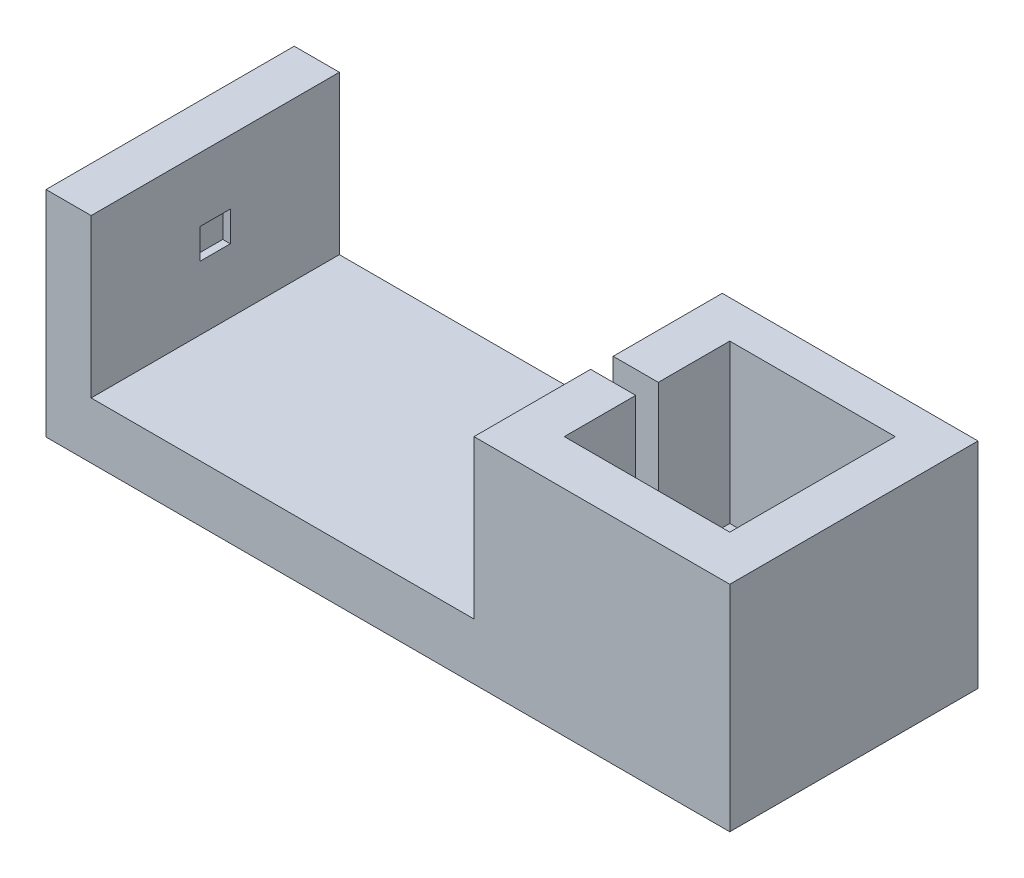
ISO-10303-21;
HEADER;
FILE_DESCRIPTION(('STEP AP214'),'2;1');
FILE_NAME('part.step','',(''),(''),'','','');
FILE_SCHEMA(('AUTOMOTIVE_DESIGN { 1 0 10303 214 1 1 1 1 }'));
ENDSEC;
DATA;
#1=APPLICATION_CONTEXT('core data for automotive mechanical design processes');
#2=APPLICATION_PROTOCOL_DEFINITION('international standard','automotive_design',2000,#1);
#3=PRODUCT_CONTEXT('',#1,'mechanical');
#4=PRODUCT('Part','Part','',(#3));
#5=PRODUCT_RELATED_PRODUCT_CATEGORY('part','',(#4));
#6=PRODUCT_DEFINITION_FORMATION('','',#4);
#7=PRODUCT_DEFINITION_CONTEXT('part definition',#1,'design');
#8=PRODUCT_DEFINITION('design','',#6,#7);
#9=PRODUCT_DEFINITION_SHAPE('','',#8);
#10=(LENGTH_UNIT() NAMED_UNIT(*) SI_UNIT(.MILLI.,.METRE.));
#11=(NAMED_UNIT(*) PLANE_ANGLE_UNIT() SI_UNIT($,.RADIAN.));
#12=(NAMED_UNIT(*) SI_UNIT($,.STERADIAN.) SOLID_ANGLE_UNIT());
#13=UNCERTAINTY_MEASURE_WITH_UNIT(LENGTH_MEASURE(1.E-05),#10,'distance_accuracy_value','');
#14=(GEOMETRIC_REPRESENTATION_CONTEXT(3) GLOBAL_UNCERTAINTY_ASSIGNED_CONTEXT((#13)) GLOBAL_UNIT_ASSIGNED_CONTEXT((#10,
#11,#12)) REPRESENTATION_CONTEXT('',''));
#15=CARTESIAN_POINT('',(0.,0.,0.));
#16=DIRECTION('',(0.,0.,1.));
#17=DIRECTION('',(1.,0.,0.));
#18=AXIS2_PLACEMENT_3D('',#15,#16,#17);
#19=CARTESIAN_POINT('',(125.8,0.,-66.));
#20=DIRECTION('',(1.,0.,0.));
#21=DIRECTION('',(0.,0.,-1.));
#22=AXIS2_PLACEMENT_3D('',#19,#20,#21);
#23=PLANE('',#22);
#24=DIRECTION('',(0.,1.,0.));
#25=VECTOR('',#24,1.);
#26=CARTESIAN_POINT('',(125.8,-25.,-37.));
#27=LINE('',#26,#25);
#28=CARTESIAN_POINT('',(125.8,-25.,-37.));
#29=VERTEX_POINT('',#28);
#30=CARTESIAN_POINT('',(125.8,0.,-37.));
#31=VERTEX_POINT('',#30);
#32=EDGE_CURVE('E210',#29,#31,#27,.T.);
#33=ORIENTED_EDGE('',*,*,#32,.F.);
#34=DIRECTION('',(0.,0.,-1.));
#35=VECTOR('',#34,1.);
#36=CARTESIAN_POINT('',(125.8,-25.,-37.));
#37=LINE('',#36,#35);
#38=CARTESIAN_POINT('',(125.8,-25.,-31.));
#39=VERTEX_POINT('',#38);
#40=EDGE_CURVE('E189',#39,#29,#37,.T.);
#41=ORIENTED_EDGE('',*,*,#40,.F.);
#42=DIRECTION('',(0.,1.,0.));
#43=VECTOR('',#42,1.);
#44=CARTESIAN_POINT('',(125.8,-25.,-31.));
#45=LINE('',#44,#43);
#46=CARTESIAN_POINT('',(125.8,0.,-31.));
#47=VERTEX_POINT('',#46);
#48=EDGE_CURVE('E185',#39,#47,#45,.T.);
#49=ORIENTED_EDGE('',*,*,#48,.T.);
#50=DIRECTION('',(0.,0.,1.));
#51=VECTOR('',#50,1.);
#52=CARTESIAN_POINT('',(125.8,0.,-66.));
#53=LINE('',#52,#51);
#54=CARTESIAN_POINT('',(125.8,0.,-12.));
#55=VERTEX_POINT('',#54);
#56=EDGE_CURVE('E368',#47,#55,#53,.T.);
#57=ORIENTED_EDGE('',*,*,#56,.T.);
#58=DIRECTION('',(0.,1.,0.));
#59=VECTOR('',#58,1.);
#60=CARTESIAN_POINT('',(125.8,0.,-12.));
#61=LINE('',#60,#59);
#62=CARTESIAN_POINT('',(125.8,-42.,-12.));
#63=VERTEX_POINT('',#62);
#64=EDGE_CURVE('E230',#63,#55,#61,.T.);
#65=ORIENTED_EDGE('',*,*,#64,.F.);
#66=DIRECTION('',(0.,0.,1.));
#67=VECTOR('',#66,1.);
#68=CARTESIAN_POINT('',(125.8,-42.,-66.));
#69=LINE('',#68,#67);
#70=CARTESIAN_POINT('',(125.8,-42.,-56.));
#71=VERTEX_POINT('',#70);
#72=EDGE_CURVE('E369',#71,#63,#69,.T.);
#73=ORIENTED_EDGE('',*,*,#72,.F.);
#74=DIRECTION('',(0.,-1.,0.));
#75=VECTOR('',#74,1.);
#76=CARTESIAN_POINT('',(125.8,-42.,-56.));
#77=LINE('',#76,#75);
#78=CARTESIAN_POINT('',(125.8,0.,-56.));
#79=VERTEX_POINT('',#78);
#80=EDGE_CURVE('E223',#79,#71,#77,.T.);
#81=ORIENTED_EDGE('',*,*,#80,.F.);
#82=EDGE_CURVE('E364',#79,#31,#53,.T.);
#83=ORIENTED_EDGE('',*,*,#82,.T.);
#84=EDGE_LOOP('',(#33,#41,#49,#57,#65,#73,#81,#83));
#85=FACE_BOUND('',#84,.T.);
#86=ADVANCED_FACE('F43',(#85),#23,.T.);
#87=CARTESIAN_POINT('',(125.8,-42.,-66.));
#88=DIRECTION('',(0.,1.,0.));
#89=DIRECTION('',(0.,0.,1.));
#90=AXIS2_PLACEMENT_3D('',#87,#88,#89);
#91=PLANE('',#90);
#92=DIRECTION('',(0.,0.,1.));
#93=VECTOR('',#92,1.);
#94=CARTESIAN_POINT('',(169.8,-42.,-66.));
#95=LINE('',#94,#93);
#96=CARTESIAN_POINT('',(169.8,-42.,-56.));
#97=VERTEX_POINT('',#96);
#98=CARTESIAN_POINT('',(169.8,-42.,-12.));
#99=VERTEX_POINT('',#98);
#100=EDGE_CURVE('E372',#97,#99,#95,.T.);
#101=ORIENTED_EDGE('',*,*,#100,.F.);
#102=DIRECTION('',(-1.,0.,0.));
#103=VECTOR('',#102,1.);
#104=CARTESIAN_POINT('',(181.802,-42.,-56.));
#105=LINE('',#104,#103);
#106=EDGE_CURVE('E69',#97,#71,#105,.T.);
#107=ORIENTED_EDGE('',*,*,#106,.T.);
#108=ORIENTED_EDGE('',*,*,#72,.T.);
#109=DIRECTION('',(-1.,0.,0.));
#110=VECTOR('',#109,1.);
#111=CARTESIAN_POINT('',(181.802,-42.,-12.));
#112=LINE('',#111,#110);
#113=EDGE_CURVE('E235',#99,#63,#112,.T.);
#114=ORIENTED_EDGE('',*,*,#113,.F.);
#115=EDGE_LOOP('',(#101,#107,#108,#114));
#116=FACE_BOUND('',#115,.T.);
#117=ADVANCED_FACE('F450',(#116),#91,.T.);
#118=CARTESIAN_POINT('',(169.8,-42.,-66.));
#119=DIRECTION('',(-1.,0.,0.));
#120=DIRECTION('',(0.,0.,1.));
#121=AXIS2_PLACEMENT_3D('',#118,#119,#120);
#122=PLANE('',#121);
#123=DIRECTION('',(0.,0.,1.));
#124=VECTOR('',#123,1.);
#125=CARTESIAN_POINT('',(169.8,0.,-66.));
#126=LINE('',#125,#124);
#127=CARTESIAN_POINT('',(169.8,0.,-56.));
#128=VERTEX_POINT('',#127);
#129=CARTESIAN_POINT('',(169.8,0.,-12.));
#130=VERTEX_POINT('',#129);
#131=EDGE_CURVE('E375',#128,#130,#126,.T.);
#132=ORIENTED_EDGE('',*,*,#131,.F.);
#133=DIRECTION('',(0.,1.,0.));
#134=VECTOR('',#133,1.);
#135=CARTESIAN_POINT('',(169.8,-42.,-56.));
#136=LINE('',#135,#134);
#137=EDGE_CURVE('E215',#97,#128,#136,.T.);
#138=ORIENTED_EDGE('',*,*,#137,.F.);
#139=ORIENTED_EDGE('',*,*,#100,.T.);
#140=DIRECTION('',(0.,-1.,0.));
#141=VECTOR('',#140,1.);
#142=CARTESIAN_POINT('',(169.8,0.,-12.));
#143=LINE('',#142,#141);
#144=EDGE_CURVE('E239',#130,#99,#143,.T.);
#145=ORIENTED_EDGE('',*,*,#144,.F.);
#146=EDGE_LOOP('',(#132,#138,#139,#145));
#147=FACE_BOUND('',#146,.T.);
#148=ADVANCED_FACE('F443',(#147),#122,.T.);
#149=CARTESIAN_POINT('',(10.,-17.,-37.));
#150=DIRECTION('',(-1.,0.,0.));
#151=DIRECTION('',(0.,0.,1.));
#152=AXIS2_PLACEMENT_3D('',#149,#150,#151);
#153=PLANE('',#152);
#154=DIRECTION('',(0.,-1.,0.));
#155=VECTOR('',#154,1.);
#156=CARTESIAN_POINT('',(10.,-17.,-29.));
#157=LINE('',#156,#155);
#158=CARTESIAN_POINT('',(10.,-17.,-29.));
#159=VERTEX_POINT('',#158);
#160=CARTESIAN_POINT('',(10.,-25.,-29.));
#161=VERTEX_POINT('',#160);
#162=EDGE_CURVE('E246',#159,#161,#157,.T.);
#163=ORIENTED_EDGE('',*,*,#162,.T.);
#164=DIRECTION('',(0.,0.,1.));
#165=VECTOR('',#164,1.);
#166=CARTESIAN_POINT('',(10.,-25.,-37.));
#167=LINE('',#166,#165);
#168=CARTESIAN_POINT('',(10.,-25.,-37.));
#169=VERTEX_POINT('',#168);
#170=EDGE_CURVE('E274',#169,#161,#167,.T.);
#171=ORIENTED_EDGE('',*,*,#170,.F.);
#172=DIRECTION('',(0.,-1.,0.));
#173=VECTOR('',#172,1.);
#174=CARTESIAN_POINT('',(10.,-17.,-37.));
#175=LINE('',#174,#173);
#176=CARTESIAN_POINT('',(10.,-17.,-37.));
#177=VERTEX_POINT('',#176);
#178=EDGE_CURVE('E259',#177,#169,#175,.T.);
#179=ORIENTED_EDGE('',*,*,#178,.F.);
#180=DIRECTION('',(0.,0.,1.));
#181=VECTOR('',#180,1.);
#182=CARTESIAN_POINT('',(10.,-17.,-37.));
#183=LINE('',#182,#181);
#184=EDGE_CURVE('E275',#177,#159,#183,.T.);
#185=ORIENTED_EDGE('',*,*,#184,.T.);
#186=EDGE_LOOP('',(#163,#171,#179,#185));
#187=FACE_BOUND('',#186,.T.);
#188=ADVANCED_FACE('F441',(#187),#153,.F.);
#189=CARTESIAN_POINT('',(12.,-17.,-37.));
#190=DIRECTION('',(0.,1.,0.));
#191=DIRECTION('',(0.,0.,1.));
#192=AXIS2_PLACEMENT_3D('',#189,#190,#191);
#193=PLANE('',#192);
#194=DIRECTION('',(-1.,0.,0.));
#195=VECTOR('',#194,1.);
#196=CARTESIAN_POINT('',(12.,-17.,-29.));
#197=LINE('',#196,#195);
#198=CARTESIAN_POINT('',(12.,-17.,-29.));
#199=VERTEX_POINT('',#198);
#200=EDGE_CURVE('E256',#199,#159,#197,.T.);
#201=ORIENTED_EDGE('',*,*,#200,.T.);
#202=ORIENTED_EDGE('',*,*,#184,.F.);
#203=DIRECTION('',(-1.,0.,0.));
#204=VECTOR('',#203,1.);
#205=CARTESIAN_POINT('',(12.,-17.,-37.));
#206=LINE('',#205,#204);
#207=CARTESIAN_POINT('',(12.,-17.,-37.));
#208=VERTEX_POINT('',#207);
#209=EDGE_CURVE('E270',#208,#177,#206,.T.);
#210=ORIENTED_EDGE('',*,*,#209,.F.);
#211=DIRECTION('',(0.,0.,1.));
#212=VECTOR('',#211,1.);
#213=CARTESIAN_POINT('',(12.,-17.,-37.));
#214=LINE('',#213,#212);
#215=EDGE_CURVE('E280',#208,#199,#214,.T.);
#216=ORIENTED_EDGE('',*,*,#215,.T.);
#217=EDGE_LOOP('',(#201,#202,#210,#216));
#218=FACE_BOUND('',#217,.T.);
#219=ADVANCED_FACE('F429',(#218),#193,.F.);
#220=CARTESIAN_POINT('',(10.,-25.,-37.));
#221=DIRECTION('',(0.,-1.,0.));
#222=DIRECTION('',(1.,0.,0.));
#223=AXIS2_PLACEMENT_3D('',#220,#221,#222);
#224=PLANE('',#223);
#225=DIRECTION('',(1.,0.,0.));
#226=VECTOR('',#225,1.);
#227=CARTESIAN_POINT('',(10.,-25.,-29.));
#228=LINE('',#227,#226);
#229=CARTESIAN_POINT('',(12.,-25.,-29.));
#230=VERTEX_POINT('',#229);
#231=EDGE_CURVE('E249',#161,#230,#228,.T.);
#232=ORIENTED_EDGE('',*,*,#231,.T.);
#233=DIRECTION('',(0.,0.,1.));
#234=VECTOR('',#233,1.);
#235=CARTESIAN_POINT('',(12.,-25.,-37.));
#236=LINE('',#235,#234);
#237=CARTESIAN_POINT('',(12.,-25.,-37.));
#238=VERTEX_POINT('',#237);
#239=EDGE_CURVE('E283',#238,#230,#236,.T.);
#240=ORIENTED_EDGE('',*,*,#239,.F.);
#241=DIRECTION('',(1.,0.,0.));
#242=VECTOR('',#241,1.);
#243=CARTESIAN_POINT('',(10.,-25.,-37.));
#244=LINE('',#243,#242);
#245=EDGE_CURVE('E263',#169,#238,#244,.T.);
#246=ORIENTED_EDGE('',*,*,#245,.F.);
#247=ORIENTED_EDGE('',*,*,#170,.T.);
#248=EDGE_LOOP('',(#232,#240,#246,#247));
#249=FACE_BOUND('',#248,.T.);
#250=ADVANCED_FACE('F435',(#249),#224,.F.);
#251=CARTESIAN_POINT('',(0.,-57.,-66.));
#252=DIRECTION('',(-1.,0.,0.));
#253=DIRECTION('',(0.,0.,1.));
#254=AXIS2_PLACEMENT_3D('',#251,#252,#253);
#255=PLANE('',#254);
#256=DIRECTION('',(0.,-1.,0.));
#257=VECTOR('',#256,1.);
#258=CARTESIAN_POINT('',(0.,-57.,0.));
#259=LINE('',#258,#257);
#260=CARTESIAN_POINT('',(0.,0.,0.));
#261=VERTEX_POINT('',#260);
#262=CARTESIAN_POINT('',(0.,-57.,0.));
#263=VERTEX_POINT('',#262);
#264=EDGE_CURVE('E279',#261,#263,#259,.T.);
#265=ORIENTED_EDGE('',*,*,#264,.F.);
#266=DIRECTION('',(0.,0.,1.));
#267=VECTOR('',#266,1.);
#268=CARTESIAN_POINT('',(0.,0.,-66.));
#269=LINE('',#268,#267);
#270=CARTESIAN_POINT('',(0.,0.,-66.));
#271=VERTEX_POINT('',#270);
#272=EDGE_CURVE('E11',#271,#261,#269,.T.);
#273=ORIENTED_EDGE('',*,*,#272,.F.);
#274=DIRECTION('',(0.,-1.,0.));
#275=VECTOR('',#274,1.);
#276=CARTESIAN_POINT('',(0.,-57.,-66.));
#277=LINE('',#276,#275);
#278=CARTESIAN_POINT('',(0.,-57.,-66.));
#279=VERTEX_POINT('',#278);
#280=EDGE_CURVE('E290',#271,#279,#277,.T.);
#281=ORIENTED_EDGE('',*,*,#280,.T.);
#282=DIRECTION('',(0.,0.,1.));
#283=VECTOR('',#282,1.);
#284=CARTESIAN_POINT('',(0.,-57.,-66.));
#285=LINE('',#284,#283);
#286=EDGE_CURVE('E47',#279,#263,#285,.T.);
#287=ORIENTED_EDGE('',*,*,#286,.T.);
#288=EDGE_LOOP('',(#265,#273,#281,#287));
#289=FACE_BOUND('',#288,.T.);
#290=ADVANCED_FACE('F45',(#289),#255,.T.);
#291=CARTESIAN_POINT('',(0.,0.,-66.));
#292=DIRECTION('',(0.,1.,0.));
#293=DIRECTION('',(0.,0.,1.));
#294=AXIS2_PLACEMENT_3D('',#291,#292,#293);
#295=PLANE('',#294);
#296=DIRECTION('',(-1.,0.,0.));
#297=VECTOR('',#296,1.);
#298=CARTESIAN_POINT('',(0.,0.,0.));
#299=LINE('',#298,#297);
#300=CARTESIAN_POINT('',(12.,0.,0.));
#301=VERTEX_POINT('',#300);
#302=EDGE_CURVE('E295',#301,#261,#299,.T.);
#303=ORIENTED_EDGE('',*,*,#302,.F.);
#304=DIRECTION('',(0.,0.,1.));
#305=VECTOR('',#304,1.);
#306=CARTESIAN_POINT('',(12.,0.,-66.));
#307=LINE('',#306,#305);
#308=CARTESIAN_POINT('',(12.,0.,-66.));
#309=VERTEX_POINT('',#308);
#310=EDGE_CURVE('E53',#309,#301,#307,.T.);
#311=ORIENTED_EDGE('',*,*,#310,.F.);
#312=DIRECTION('',(-1.,0.,0.));
#313=VECTOR('',#312,1.);
#314=CARTESIAN_POINT('',(0.,0.,-66.));
#315=LINE('',#314,#313);
#316=EDGE_CURVE('E318',#309,#271,#315,.T.);
#317=ORIENTED_EDGE('',*,*,#316,.T.);
#318=ORIENTED_EDGE('',*,*,#272,.T.);
#319=EDGE_LOOP('',(#303,#311,#317,#318));
#320=FACE_BOUND('',#319,.T.);
#321=ADVANCED_FACE('F397',(#320),#295,.T.);
#322=CARTESIAN_POINT('',(12.,0.,-66.));
#323=DIRECTION('',(1.,0.,0.));
#324=DIRECTION('',(0.,1.,0.));
#325=AXIS2_PLACEMENT_3D('',#322,#323,#324);
#326=PLANE('',#325);
#327=ORIENTED_EDGE('',*,*,#310,.T.);
#328=DIRECTION('',(0.,1.,0.));
#329=VECTOR('',#328,1.);
#330=CARTESIAN_POINT('',(12.,0.,0.));
#331=LINE('',#330,#329);
#332=CARTESIAN_POINT('',(12.,-42.,0.));
#333=VERTEX_POINT('',#332);
#334=EDGE_CURVE('E345',#333,#301,#331,.T.);
#335=ORIENTED_EDGE('',*,*,#334,.F.);
#336=DIRECTION('',(0.,0.,1.));
#337=VECTOR('',#336,1.);
#338=CARTESIAN_POINT('',(12.,-42.,-66.));
#339=LINE('',#338,#337);
#340=CARTESIAN_POINT('',(12.,-42.,-66.));
#341=VERTEX_POINT('',#340);
#342=EDGE_CURVE('E354',#341,#333,#339,.T.);
#343=ORIENTED_EDGE('',*,*,#342,.F.);
#344=DIRECTION('',(0.,1.,0.));
#345=VECTOR('',#344,1.);
#346=CARTESIAN_POINT('',(12.,0.,-66.));
#347=LINE('',#346,#345);
#348=EDGE_CURVE('E314',#341,#309,#347,.T.);
#349=ORIENTED_EDGE('',*,*,#348,.T.);
#350=EDGE_LOOP('',(#327,#335,#343,#349));
#351=FACE_BOUND('',#350,.T.);
#352=ORIENTED_EDGE('',*,*,#215,.F.);
#353=DIRECTION('',(0.,1.,0.));
#354=VECTOR('',#353,1.);
#355=CARTESIAN_POINT('',(12.,-25.,-37.));
#356=LINE('',#355,#354);
#357=EDGE_CURVE('E267',#238,#208,#356,.T.);
#358=ORIENTED_EDGE('',*,*,#357,.F.);
#359=ORIENTED_EDGE('',*,*,#239,.T.);
#360=DIRECTION('',(0.,1.,0.));
#361=VECTOR('',#360,1.);
#362=CARTESIAN_POINT('',(12.,-25.,-29.));
#363=LINE('',#362,#361);
#364=EDGE_CURVE('E252',#230,#199,#363,.T.);
#365=ORIENTED_EDGE('',*,*,#364,.T.);
#366=EDGE_LOOP('',(#352,#358,#359,#365));
#367=FACE_BOUND('',#366,.T.);
#368=ADVANCED_FACE('F419',(#351,#367),#326,.T.);
#369=CARTESIAN_POINT('',(12.,-42.,-66.));
#370=DIRECTION('',(0.,1.,0.));
#371=DIRECTION('',(0.,0.,1.));
#372=AXIS2_PLACEMENT_3D('',#369,#370,#371);
#373=PLANE('',#372);
#374=DIRECTION('',(-1.,0.,0.));
#375=VECTOR('',#374,1.);
#376=CARTESIAN_POINT('',(12.,-42.,0.));
#377=LINE('',#376,#375);
#378=CARTESIAN_POINT('',(113.8,-42.,0.));
#379=VERTEX_POINT('',#378);
#380=EDGE_CURVE('E341',#379,#333,#377,.T.);
#381=ORIENTED_EDGE('',*,*,#380,.F.);
#382=DIRECTION('',(0.,0.,1.));
#383=VECTOR('',#382,1.);
#384=CARTESIAN_POINT('',(113.8,-42.,-66.));
#385=LINE('',#384,#383);
#386=CARTESIAN_POINT('',(113.8,-42.,-66.));
#387=VERTEX_POINT('',#386);
#388=EDGE_CURVE('E357',#387,#379,#385,.T.);
#389=ORIENTED_EDGE('',*,*,#388,.F.);
#390=DIRECTION('',(-1.,0.,0.));
#391=VECTOR('',#390,1.);
#392=CARTESIAN_POINT('',(12.,-42.,-66.));
#393=LINE('',#392,#391);
#394=EDGE_CURVE('E310',#387,#341,#393,.T.);
#395=ORIENTED_EDGE('',*,*,#394,.T.);
#396=ORIENTED_EDGE('',*,*,#342,.T.);
#397=EDGE_LOOP('',(#381,#389,#395,#396));
#398=FACE_BOUND('',#397,.T.);
#399=ADVANCED_FACE('F417',(#398),#373,.T.);
#400=CARTESIAN_POINT('',(113.8,-42.,-66.));
#401=DIRECTION('',(-1.,0.,0.));
#402=DIRECTION('',(0.,0.,1.));
#403=AXIS2_PLACEMENT_3D('',#400,#401,#402);
#404=PLANE('',#403);
#405=DIRECTION('',(0.,1.,0.));
#406=VECTOR('',#405,1.);
#407=CARTESIAN_POINT('',(113.8,-25.,-37.));
#408=LINE('',#407,#406);
#409=CARTESIAN_POINT('',(113.8,-25.,-37.));
#410=VERTEX_POINT('',#409);
#411=CARTESIAN_POINT('',(113.8,0.,-37.));
#412=VERTEX_POINT('',#411);
#413=EDGE_CURVE('E220',#410,#412,#408,.T.);
#414=ORIENTED_EDGE('',*,*,#413,.T.);
#415=DIRECTION('',(0.,0.,1.));
#416=VECTOR('',#415,1.);
#417=CARTESIAN_POINT('',(113.8,0.,-66.));
#418=LINE('',#417,#416);
#419=CARTESIAN_POINT('',(113.8,0.,-66.));
#420=VERTEX_POINT('',#419);
#421=EDGE_CURVE('E360',#420,#412,#418,.T.);
#422=ORIENTED_EDGE('',*,*,#421,.F.);
#423=DIRECTION('',(0.,-1.,0.));
#424=VECTOR('',#423,1.);
#425=CARTESIAN_POINT('',(113.8,-42.,-66.));
#426=LINE('',#425,#424);
#427=EDGE_CURVE('E306',#420,#387,#426,.T.);
#428=ORIENTED_EDGE('',*,*,#427,.T.);
#429=ORIENTED_EDGE('',*,*,#388,.T.);
#430=DIRECTION('',(0.,-1.,0.));
#431=VECTOR('',#430,1.);
#432=CARTESIAN_POINT('',(113.8,-42.,0.));
#433=LINE('',#432,#431);
#434=CARTESIAN_POINT('',(113.8,0.,0.));
#435=VERTEX_POINT('',#434);
#436=EDGE_CURVE('E337',#435,#379,#433,.T.);
#437=ORIENTED_EDGE('',*,*,#436,.F.);
#438=CARTESIAN_POINT('',(113.8,0.,-31.));
#439=VERTEX_POINT('',#438);
#440=EDGE_CURVE('E205',#439,#435,#418,.T.);
#441=ORIENTED_EDGE('',*,*,#440,.F.);
#442=DIRECTION('',(0.,1.,0.));
#443=VECTOR('',#442,1.);
#444=CARTESIAN_POINT('',(113.8,-25.,-31.));
#445=LINE('',#444,#443);
#446=CARTESIAN_POINT('',(113.8,-25.,-31.));
#447=VERTEX_POINT('',#446);
#448=EDGE_CURVE('E61',#447,#439,#445,.T.);
#449=ORIENTED_EDGE('',*,*,#448,.F.);
#450=DIRECTION('',(0.,0.,1.));
#451=VECTOR('',#450,1.);
#452=CARTESIAN_POINT('',(113.8,-25.,-31.));
#453=LINE('',#452,#451);
#454=EDGE_CURVE('E190',#410,#447,#453,.T.);
#455=ORIENTED_EDGE('',*,*,#454,.F.);
#456=EDGE_LOOP('',(#414,#422,#428,#429,#437,#441,#449,#455));
#457=FACE_BOUND('',#456,.T.);
#458=ADVANCED_FACE('F203',(#457),#404,.T.);
#459=CARTESIAN_POINT('',(113.8,0.,-66.));
#460=DIRECTION('',(0.,1.,0.));
#461=DIRECTION('',(0.,0.,1.));
#462=AXIS2_PLACEMENT_3D('',#459,#460,#461);
#463=PLANE('',#462);
#464=DIRECTION('',(-1.,0.,0.));
#465=VECTOR('',#464,1.);
#466=CARTESIAN_POINT('',(113.8,0.,-37.));
#467=LINE('',#466,#465);
#468=EDGE_CURVE('E200',#31,#412,#467,.T.);
#469=ORIENTED_EDGE('',*,*,#468,.F.);
#470=ORIENTED_EDGE('',*,*,#82,.F.);
#471=DIRECTION('',(-1.,0.,0.));
#472=VECTOR('',#471,1.);
#473=CARTESIAN_POINT('',(181.802,0.,-56.));
#474=LINE('',#473,#472);
#475=EDGE_CURVE('E219',#128,#79,#474,.T.);
#476=ORIENTED_EDGE('',*,*,#475,.F.);
#477=ORIENTED_EDGE('',*,*,#131,.T.);
#478=DIRECTION('',(-1.,0.,0.));
#479=VECTOR('',#478,1.);
#480=CARTESIAN_POINT('',(181.802,0.,-12.));
#481=LINE('',#480,#479);
#482=EDGE_CURVE('E234',#130,#55,#481,.T.);
#483=ORIENTED_EDGE('',*,*,#482,.T.);
#484=ORIENTED_EDGE('',*,*,#56,.F.);
#485=DIRECTION('',(1.,0.,0.));
#486=VECTOR('',#485,1.);
#487=CARTESIAN_POINT('',(125.8,0.,-31.));
#488=LINE('',#487,#486);
#489=EDGE_CURVE('E411',#439,#47,#488,.T.);
#490=ORIENTED_EDGE('',*,*,#489,.F.);
#491=ORIENTED_EDGE('',*,*,#440,.T.);
#492=DIRECTION('',(-1.,0.,0.));
#493=VECTOR('',#492,1.);
#494=CARTESIAN_POINT('',(113.8,0.,0.));
#495=LINE('',#494,#493);
#496=CARTESIAN_POINT('',(181.8,0.,0.));
#497=VERTEX_POINT('',#496);
#498=EDGE_CURVE('E333',#497,#435,#495,.T.);
#499=ORIENTED_EDGE('',*,*,#498,.F.);
#500=DIRECTION('',(0.,0.,1.));
#501=VECTOR('',#500,1.);
#502=CARTESIAN_POINT('',(181.8,0.,-66.));
#503=LINE('',#502,#501);
#504=CARTESIAN_POINT('',(181.8,0.,-66.));
#505=VERTEX_POINT('',#504);
#506=EDGE_CURVE('E378',#505,#497,#503,.T.);
#507=ORIENTED_EDGE('',*,*,#506,.F.);
#508=DIRECTION('',(-1.,0.,0.));
#509=VECTOR('',#508,1.);
#510=CARTESIAN_POINT('',(169.8,0.,-66.));
#511=LINE('',#510,#509);
#512=EDGE_CURVE('E303',#505,#420,#511,.T.);
#513=ORIENTED_EDGE('',*,*,#512,.T.);
#514=ORIENTED_EDGE('',*,*,#421,.T.);
#515=EDGE_LOOP('',(#469,#470,#476,#477,#483,#484,#490,#491,#499,#507,#513,#514));
#516=FACE_BOUND('',#515,.T.);
#517=ADVANCED_FACE('F409',(#516),#463,.T.);
#518=CARTESIAN_POINT('',(181.8,0.,-66.));
#519=DIRECTION('',(1.,0.,0.));
#520=DIRECTION('',(0.,0.,-1.));
#521=AXIS2_PLACEMENT_3D('',#518,#519,#520);
#522=PLANE('',#521);
#523=DIRECTION('',(0.,1.,0.));
#524=VECTOR('',#523,1.);
#525=CARTESIAN_POINT('',(181.8,0.,0.));
#526=LINE('',#525,#524);
#527=CARTESIAN_POINT('',(181.8,-57.,0.));
#528=VERTEX_POINT('',#527);
#529=EDGE_CURVE('E329',#528,#497,#526,.T.);
#530=ORIENTED_EDGE('',*,*,#529,.F.);
#531=DIRECTION('',(0.,0.,1.));
#532=VECTOR('',#531,1.);
#533=CARTESIAN_POINT('',(181.8,-57.,-66.));
#534=LINE('',#533,#532);
#535=CARTESIAN_POINT('',(181.8,-57.,-66.));
#536=VERTEX_POINT('',#535);
#537=EDGE_CURVE('E381',#536,#528,#534,.T.);
#538=ORIENTED_EDGE('',*,*,#537,.F.);
#539=DIRECTION('',(0.,1.,0.));
#540=VECTOR('',#539,1.);
#541=CARTESIAN_POINT('',(181.8,0.,-66.));
#542=LINE('',#541,#540);
#543=EDGE_CURVE('E299',#536,#505,#542,.T.);
#544=ORIENTED_EDGE('',*,*,#543,.T.);
#545=ORIENTED_EDGE('',*,*,#506,.T.);
#546=EDGE_LOOP('',(#530,#538,#544,#545));
#547=FACE_BOUND('',#546,.T.);
#548=ADVANCED_FACE('F406',(#547),#522,.T.);
#549=CARTESIAN_POINT('',(181.8,-57.,-66.));
#550=DIRECTION('',(0.,-1.,0.));
#551=DIRECTION('',(1.,0.,0.));
#552=AXIS2_PLACEMENT_3D('',#549,#550,#551);
#553=PLANE('',#552);
#554=DIRECTION('',(1.,0.,0.));
#555=VECTOR('',#554,1.);
#556=CARTESIAN_POINT('',(181.8,-57.,0.));
#557=LINE('',#556,#555);
#558=EDGE_CURVE('E325',#263,#528,#557,.T.);
#559=ORIENTED_EDGE('',*,*,#558,.F.);
#560=ORIENTED_EDGE('',*,*,#286,.F.);
#561=DIRECTION('',(1.,0.,0.));
#562=VECTOR('',#561,1.);
#563=CARTESIAN_POINT('',(181.8,-57.,-66.));
#564=LINE('',#563,#562);
#565=EDGE_CURVE('E294',#279,#536,#564,.T.);
#566=ORIENTED_EDGE('',*,*,#565,.T.);
#567=ORIENTED_EDGE('',*,*,#537,.T.);
#568=EDGE_LOOP('',(#559,#560,#566,#567));
#569=FACE_BOUND('',#568,.T.);
#570=ADVANCED_FACE('F391',(#569),#553,.T.);
#571=CARTESIAN_POINT('',(0.,0.,-66.));
#572=DIRECTION('',(0.,0.,-1.));
#573=DIRECTION('',(-1.,0.,0.));
#574=AXIS2_PLACEMENT_3D('',#571,#572,#573);
#575=PLANE('',#574);
#576=ORIENTED_EDGE('',*,*,#427,.F.);
#577=ORIENTED_EDGE('',*,*,#512,.F.);
#578=ORIENTED_EDGE('',*,*,#543,.F.);
#579=ORIENTED_EDGE('',*,*,#565,.F.);
#580=ORIENTED_EDGE('',*,*,#280,.F.);
#581=ORIENTED_EDGE('',*,*,#316,.F.);
#582=ORIENTED_EDGE('',*,*,#348,.F.);
#583=ORIENTED_EDGE('',*,*,#394,.F.);
#584=EDGE_LOOP('',(#576,#577,#578,#579,#580,#581,#582,#583));
#585=FACE_BOUND('',#584,.T.);
#586=ADVANCED_FACE('F401',(#585),#575,.T.);
#587=CARTESIAN_POINT('',(0.,0.,0.));
#588=DIRECTION('',(0.,0.,-1.));
#589=DIRECTION('',(-1.,0.,0.));
#590=AXIS2_PLACEMENT_3D('',#587,#588,#589);
#591=PLANE('',#590);
#592=ORIENTED_EDGE('',*,*,#529,.T.);
#593=ORIENTED_EDGE('',*,*,#498,.T.);
#594=ORIENTED_EDGE('',*,*,#436,.T.);
#595=ORIENTED_EDGE('',*,*,#380,.T.);
#596=ORIENTED_EDGE('',*,*,#334,.T.);
#597=ORIENTED_EDGE('',*,*,#302,.T.);
#598=ORIENTED_EDGE('',*,*,#264,.T.);
#599=ORIENTED_EDGE('',*,*,#558,.T.);
#600=EDGE_LOOP('',(#592,#593,#594,#595,#596,#597,#598,#599));
#601=FACE_BOUND('',#600,.T.);
#602=ADVANCED_FACE('F393',(#601),#591,.F.);
#603=CARTESIAN_POINT('',(0.,0.,-37.));
#604=DIRECTION('',(0.,0.,1.));
#605=DIRECTION('',(1.,0.,0.));
#606=AXIS2_PLACEMENT_3D('',#603,#604,#605);
#607=PLANE('',#606);
#608=ORIENTED_EDGE('',*,*,#178,.T.);
#609=ORIENTED_EDGE('',*,*,#245,.T.);
#610=ORIENTED_EDGE('',*,*,#357,.T.);
#611=ORIENTED_EDGE('',*,*,#209,.T.);
#612=EDGE_LOOP('',(#608,#609,#610,#611));
#613=FACE_BOUND('',#612,.T.);
#614=ADVANCED_FACE('F432',(#613),#607,.T.);
#615=CARTESIAN_POINT('',(0.,0.,-29.));
#616=DIRECTION('',(0.,0.,1.));
#617=DIRECTION('',(1.,0.,0.));
#618=AXIS2_PLACEMENT_3D('',#615,#616,#617);
#619=PLANE('',#618);
#620=ORIENTED_EDGE('',*,*,#162,.F.);
#621=ORIENTED_EDGE('',*,*,#200,.F.);
#622=ORIENTED_EDGE('',*,*,#364,.F.);
#623=ORIENTED_EDGE('',*,*,#231,.F.);
#624=EDGE_LOOP('',(#620,#621,#622,#623));
#625=FACE_BOUND('',#624,.T.);
#626=ADVANCED_FACE('F439',(#625),#619,.F.);
#627=CARTESIAN_POINT('',(181.802,0.,-12.));
#628=DIRECTION('',(0.,0.,1.));
#629=DIRECTION('',(1.,0.,0.));
#630=AXIS2_PLACEMENT_3D('',#627,#628,#629);
#631=PLANE('',#630);
#632=ORIENTED_EDGE('',*,*,#482,.F.);
#633=ORIENTED_EDGE('',*,*,#144,.T.);
#634=ORIENTED_EDGE('',*,*,#113,.T.);
#635=ORIENTED_EDGE('',*,*,#64,.T.);
#636=EDGE_LOOP('',(#632,#633,#634,#635));
#637=FACE_BOUND('',#636,.T.);
#638=ADVANCED_FACE('F548',(#637),#631,.F.);
#639=CARTESIAN_POINT('',(181.802,-42.,-56.));
#640=DIRECTION('',(0.,0.,-1.));
#641=DIRECTION('',(-1.,0.,0.));
#642=AXIS2_PLACEMENT_3D('',#639,#640,#641);
#643=PLANE('',#642);
#644=ORIENTED_EDGE('',*,*,#106,.F.);
#645=ORIENTED_EDGE('',*,*,#137,.T.);
#646=ORIENTED_EDGE('',*,*,#475,.T.);
#647=ORIENTED_EDGE('',*,*,#80,.T.);
#648=EDGE_LOOP('',(#644,#645,#646,#647));
#649=FACE_BOUND('',#648,.T.);
#650=ADVANCED_FACE('F583',(#649),#643,.F.);
#651=CARTESIAN_POINT('',(113.8,-25.,-37.));
#652=DIRECTION('',(0.,0.,-1.));
#653=DIRECTION('',(-1.,0.,0.));
#654=AXIS2_PLACEMENT_3D('',#651,#652,#653);
#655=PLANE('',#654);
#656=ORIENTED_EDGE('',*,*,#468,.T.);
#657=ORIENTED_EDGE('',*,*,#413,.F.);
#658=DIRECTION('',(-1.,0.,0.));
#659=VECTOR('',#658,1.);
#660=CARTESIAN_POINT('',(113.8,-25.,-37.));
#661=LINE('',#660,#659);
#662=EDGE_CURVE('E196',#29,#410,#661,.T.);
#663=ORIENTED_EDGE('',*,*,#662,.F.);
#664=ORIENTED_EDGE('',*,*,#32,.T.);
#665=EDGE_LOOP('',(#656,#657,#663,#664));
#666=FACE_BOUND('',#665,.T.);
#667=ADVANCED_FACE('F593',(#666),#655,.F.);
#668=CARTESIAN_POINT('',(125.8,-25.,-31.));
#669=DIRECTION('',(0.,0.,1.));
#670=DIRECTION('',(1.,0.,0.));
#671=AXIS2_PLACEMENT_3D('',#668,#669,#670);
#672=PLANE('',#671);
#673=ORIENTED_EDGE('',*,*,#489,.T.);
#674=ORIENTED_EDGE('',*,*,#48,.F.);
#675=DIRECTION('',(1.,0.,0.));
#676=VECTOR('',#675,1.);
#677=CARTESIAN_POINT('',(125.8,-25.,-31.));
#678=LINE('',#677,#676);
#679=EDGE_CURVE('E181',#447,#39,#678,.T.);
#680=ORIENTED_EDGE('',*,*,#679,.F.);
#681=ORIENTED_EDGE('',*,*,#448,.T.);
#682=EDGE_LOOP('',(#673,#674,#680,#681));
#683=FACE_BOUND('',#682,.T.);
#684=ADVANCED_FACE('F183',(#683),#672,.F.);
#685=CARTESIAN_POINT('',(0.,-25.,0.));
#686=DIRECTION('',(0.,-1.,0.));
#687=DIRECTION('',(0.,0.,-1.));
#688=AXIS2_PLACEMENT_3D('',#685,#686,#687);
#689=PLANE('',#688);
#690=ORIENTED_EDGE('',*,*,#454,.T.);
#691=ORIENTED_EDGE('',*,*,#679,.T.);
#692=ORIENTED_EDGE('',*,*,#40,.T.);
#693=ORIENTED_EDGE('',*,*,#662,.T.);
#694=EDGE_LOOP('',(#690,#691,#692,#693));
#695=FACE_BOUND('',#694,.T.);
#696=ADVANCED_FACE('F194',(#695),#689,.F.);
#697=CLOSED_SHELL('',(#86,#117,#148,#188,#219,#250,#290,#321,#368,#399,#458,#517,#548,#570,#586,
#602,#614,#626,#638,#650,#667,#684,#696));
#698=MANIFOLD_SOLID_BREP('B2',#697);
#699=ADVANCED_BREP_SHAPE_REPRESENTATION('',(#18,#698),#14);
#700=SHAPE_DEFINITION_REPRESENTATION(#9,#699);
ENDSEC;
END-ISO-10303-21;
